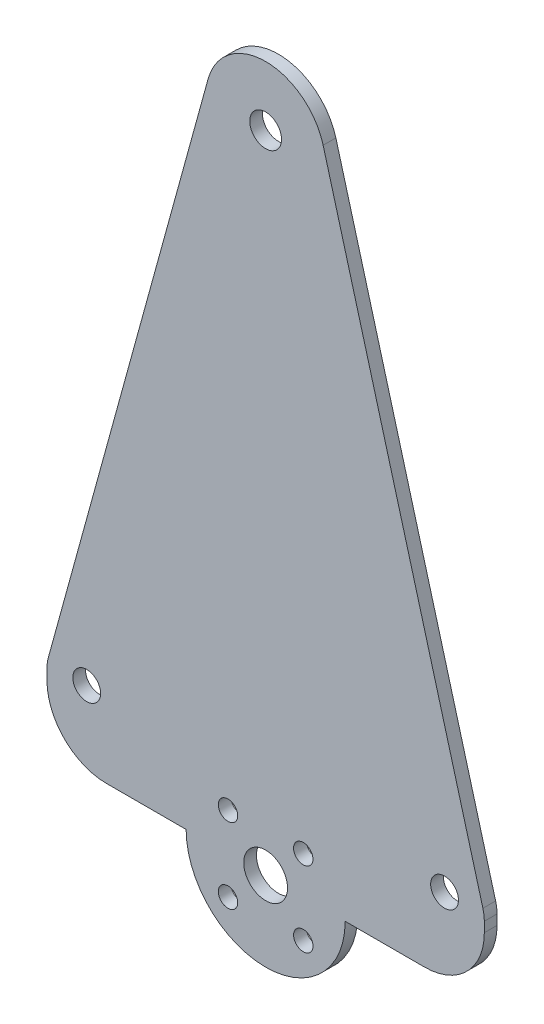
ISO-10303-21;
HEADER;
FILE_DESCRIPTION(('STEP AP214'),'2;1');
FILE_NAME('part.step','',(''),(''),'','','');
FILE_SCHEMA(('AUTOMOTIVE_DESIGN { 1 0 10303 214 1 1 1 1 }'));
ENDSEC;
DATA;
#1=APPLICATION_CONTEXT('core data for automotive mechanical design processes');
#2=APPLICATION_PROTOCOL_DEFINITION('international standard','automotive_design',2000,#1);
#3=PRODUCT_CONTEXT('',#1,'mechanical');
#4=PRODUCT('Part','Part','',(#3));
#5=PRODUCT_RELATED_PRODUCT_CATEGORY('part','',(#4));
#6=PRODUCT_DEFINITION_FORMATION('','',#4);
#7=PRODUCT_DEFINITION_CONTEXT('part definition',#1,'design');
#8=PRODUCT_DEFINITION('design','',#6,#7);
#9=PRODUCT_DEFINITION_SHAPE('','',#8);
#10=(LENGTH_UNIT() NAMED_UNIT(*) SI_UNIT(.MILLI.,.METRE.));
#11=(NAMED_UNIT(*) PLANE_ANGLE_UNIT() SI_UNIT($,.RADIAN.));
#12=(NAMED_UNIT(*) SI_UNIT($,.STERADIAN.) SOLID_ANGLE_UNIT());
#13=UNCERTAINTY_MEASURE_WITH_UNIT(LENGTH_MEASURE(1.E-05),#10,'distance_accuracy_value','');
#14=(GEOMETRIC_REPRESENTATION_CONTEXT(3) GLOBAL_UNCERTAINTY_ASSIGNED_CONTEXT((#13)) GLOBAL_UNIT_ASSIGNED_CONTEXT((#10,
#11,#12)) REPRESENTATION_CONTEXT('',''));
#15=CARTESIAN_POINT('',(0.,0.,0.));
#16=DIRECTION('',(0.,0.,1.));
#17=DIRECTION('',(1.,0.,0.));
#18=AXIS2_PLACEMENT_3D('',#15,#16,#17);
#19=CARTESIAN_POINT('',(0.,-0.85721364647119,2.032));
#20=DIRECTION('',(0.,0.,-1.));
#21=DIRECTION('',(-1.,0.,0.));
#22=AXIS2_PLACEMENT_3D('',#19,#20,#21);
#23=PLANE('',#22);
#24=CARTESIAN_POINT('',(34.5854076400856,-5.9593060063855,2.032));
#25=DIRECTION('',(0.,0.,1.));
#26=DIRECTION('',(1.,0.,0.));
#27=AXIS2_PLACEMENT_3D('',#24,#25,#26);
#28=CIRCLE('',#27,1.55);
#29=CARTESIAN_POINT('',(36.1354076400857,-5.9593060063855,2.032));
#30=VERTEX_POINT('',#29);
#31=EDGE_CURVE('E308',#30,#30,#28,.T.);
#32=ORIENTED_EDGE('',*,*,#31,.F.);
#33=EDGE_LOOP('',(#32));
#34=FACE_BOUND('',#33,.T.);
#35=CARTESIAN_POINT('',(28.575,-11.9697136464712,2.032));
#36=DIRECTION('',(0.,0.,1.));
#37=DIRECTION('',(1.,0.,0.));
#38=AXIS2_PLACEMENT_3D('',#35,#36,#37);
#39=CIRCLE('',#38,3.5);
#40=CARTESIAN_POINT('',(32.075,-11.9697136464712,2.032));
#41=VERTEX_POINT('',#40);
#42=EDGE_CURVE('E320',#41,#41,#39,.T.);
#43=ORIENTED_EDGE('',*,*,#42,.F.);
#44=EDGE_LOOP('',(#43));
#45=FACE_BOUND('',#44,.T.);
#46=CARTESIAN_POINT('',(28.5750000000013,91.0778159001085,2.032));
#47=DIRECTION('',(0.,0.,1.));
#48=DIRECTION('',(1.,0.,0.));
#49=AXIS2_PLACEMENT_3D('',#46,#47,#48);
#50=CIRCLE('',#49,2.53999999819223);
#51=CARTESIAN_POINT('',(31.1149999981935,91.0778159001085,2.032));
#52=VERTEX_POINT('',#51);
#53=EDGE_CURVE('E332',#52,#52,#50,.T.);
#54=ORIENTED_EDGE('',*,*,#53,.F.);
#55=EDGE_LOOP('',(#54));
#56=FACE_BOUND('',#55,.T.);
#57=CARTESIAN_POINT('',(0.,0.,2.032));
#58=DIRECTION('',(0.,0.,1.));
#59=DIRECTION('',(1.,0.,0.));
#60=AXIS2_PLACEMENT_3D('',#57,#58,#59);
#61=CIRCLE('',#60,2.2225);
#62=CARTESIAN_POINT('',(2.2225,0.,2.032));
#63=VERTEX_POINT('',#62);
#64=EDGE_CURVE('E158',#63,#63,#61,.T.);
#65=ORIENTED_EDGE('',*,*,#64,.F.);
#66=EDGE_LOOP('',(#65));
#67=FACE_BOUND('',#66,.T.);
#68=CARTESIAN_POINT('',(0.,-0.85721364647119,2.032));
#69=DIRECTION('',(0.,0.,1.));
#70=DIRECTION('',(-1.,0.,0.));
#71=AXIS2_PLACEMENT_3D('',#68,#69,#70);
#72=CIRCLE('',#71,6.34999999999994);
#73=CARTESIAN_POINT('',(-6.12270424433272,0.826530020607801,2.032));
#74=VERTEX_POINT('',#73);
#75=CARTESIAN_POINT('',(-6.35,-0.857213646471191,2.032));
#76=VERTEX_POINT('',#75);
#77=EDGE_CURVE('E177',#74,#76,#72,.T.);
#78=ORIENTED_EDGE('',*,*,#77,.T.);
#79=DIRECTION('',(0.,-1.,0.));
#80=VECTOR('',#79,1.);
#81=CARTESIAN_POINT('',(-6.35,-2.44471364647112,2.032));
#82=LINE('',#81,#80);
#83=CARTESIAN_POINT('',(-6.35,-2.44471364647112,2.032));
#84=VERTEX_POINT('',#83);
#85=EDGE_CURVE('E105',#76,#84,#82,.T.);
#86=ORIENTED_EDGE('',*,*,#85,.T.);
#87=CARTESIAN_POINT('',(3.175,-2.44471364647119,2.032));
#88=DIRECTION('',(0.,0.,1.));
#89=DIRECTION('',(1.,0.,0.));
#90=AXIS2_PLACEMENT_3D('',#87,#88,#89);
#91=CIRCLE('',#90,9.525);
#92=CARTESIAN_POINT('',(3.17500000000007,-11.9697136464712,2.032));
#93=VERTEX_POINT('',#92);
#94=EDGE_CURVE('E204',#84,#93,#91,.T.);
#95=ORIENTED_EDGE('',*,*,#94,.T.);
#96=DIRECTION('',(1.,0.,0.));
#97=VECTOR('',#96,1.);
#98=CARTESIAN_POINT('',(15.875,-11.9697136464712,2.032));
#99=LINE('',#98,#97);
#100=CARTESIAN_POINT('',(15.875,-11.9697136464712,2.032));
#101=VERTEX_POINT('',#100);
#102=EDGE_CURVE('E223',#93,#101,#99,.T.);
#103=ORIENTED_EDGE('',*,*,#102,.T.);
#104=CARTESIAN_POINT('',(28.575,-11.9697136464712,2.032));
#105=DIRECTION('',(0.,0.,1.));
#106=DIRECTION('',(1.,0.,0.));
#107=AXIS2_PLACEMENT_3D('',#104,#105,#106);
#108=CIRCLE('',#107,12.7);
#109=CARTESIAN_POINT('',(41.275,-11.9697136464711,2.032));
#110=VERTEX_POINT('',#109);
#111=EDGE_CURVE('E220',#101,#110,#108,.T.);
#112=ORIENTED_EDGE('',*,*,#111,.T.);
#113=DIRECTION('',(1.,0.,0.));
#114=VECTOR('',#113,1.);
#115=CARTESIAN_POINT('',(41.275,-11.9697136464711,2.032));
#116=LINE('',#115,#114);
#117=CARTESIAN_POINT('',(53.9750000000001,-11.9697136464711,2.032));
#118=VERTEX_POINT('',#117);
#119=EDGE_CURVE('E222',#110,#118,#116,.T.);
#120=ORIENTED_EDGE('',*,*,#119,.T.);
#121=CARTESIAN_POINT('',(53.9750000000002,-2.44471364647115,2.032));
#122=DIRECTION('',(0.,0.,1.));
#123=DIRECTION('',(1.,0.,0.));
#124=AXIS2_PLACEMENT_3D('',#121,#122,#123);
#125=CIRCLE('',#124,9.525);
#126=CARTESIAN_POINT('',(63.5000000000002,-2.44471364647108,2.032));
#127=VERTEX_POINT('',#126);
#128=EDGE_CURVE('E225',#118,#127,#125,.T.);
#129=ORIENTED_EDGE('',*,*,#128,.T.);
#130=DIRECTION('',(0.,1.,0.));
#131=VECTOR('',#130,1.);
#132=CARTESIAN_POINT('',(63.5000000000002,-0.85721364647109,2.032));
#133=LINE('',#132,#131);
#134=CARTESIAN_POINT('',(63.5000000000002,-0.85721364647109,2.032));
#135=VERTEX_POINT('',#134);
#136=EDGE_CURVE('E231',#127,#135,#133,.T.);
#137=ORIENTED_EDGE('',*,*,#136,.T.);
#138=CARTESIAN_POINT('',(57.1499999991986,-0.857213646471091,2.032));
#139=DIRECTION('',(0.,0.,1.));
#140=DIRECTION('',(1.,0.,0.));
#141=AXIS2_PLACEMENT_3D('',#138,#139,#140);
#142=CIRCLE('',#141,6.35000000080159);
#143=CARTESIAN_POINT('',(63.2727042443038,0.826530020822582,2.032));
#144=VERTEX_POINT('',#143);
#145=EDGE_CURVE('E136',#135,#144,#142,.T.);
#146=ORIENTED_EDGE('',*,*,#145,.T.);
#147=DIRECTION('',(-0.265156483004902,0.964205392808229,0.));
#148=VECTOR('',#147,1.);
#149=CARTESIAN_POINT('',(63.2727042443038,0.826530020822582,2.032));
#150=LINE('',#149,#148);
#151=CARTESIAN_POINT('',(37.7590563664997,93.6034314007302,2.032));
#152=VERTEX_POINT('',#151);
#153=EDGE_CURVE('E130',#144,#152,#150,.T.);
#154=ORIENTED_EDGE('',*,*,#153,.T.);
#155=CARTESIAN_POINT('',(28.5750000000013,91.0778159001085,2.032));
#156=DIRECTION('',(0.,0.,1.));
#157=DIRECTION('',(1.,0.,0.));
#158=AXIS2_PLACEMENT_3D('',#155,#156,#157);
#159=CIRCLE('',#158,9.525);
#160=CARTESIAN_POINT('',(19.3909436335022,93.6034314007276,2.032));
#161=VERTEX_POINT('',#160);
#162=EDGE_CURVE('E134',#152,#161,#159,.T.);
#163=ORIENTED_EDGE('',*,*,#162,.T.);
#164=DIRECTION('',(-0.265156483004636,-0.964205392808302,0.));
#165=VECTOR('',#164,1.);
#166=CARTESIAN_POINT('',(19.3909436335022,93.6034314007276,2.032));
#167=LINE('',#166,#165);
#168=EDGE_CURVE('E50',#161,#74,#167,.T.);
#169=ORIENTED_EDGE('',*,*,#168,.T.);
#170=EDGE_LOOP('',(#78,#86,#95,#103,#112,#120,#129,#137,#146,#154,#163,#169));
#171=FACE_BOUND('',#170,.T.);
#172=CARTESIAN_POINT('',(57.15,0.,2.032));
#173=DIRECTION('',(0.,0.,1.));
#174=DIRECTION('',(1.,0.,0.));
#175=AXIS2_PLACEMENT_3D('',#172,#173,#174);
#176=CIRCLE('',#175,2.2225);
#177=CARTESIAN_POINT('',(59.3725,0.,2.032));
#178=VERTEX_POINT('',#177);
#179=EDGE_CURVE('E338',#178,#178,#176,.T.);
#180=ORIENTED_EDGE('',*,*,#179,.F.);
#181=EDGE_LOOP('',(#180));
#182=FACE_BOUND('',#181,.T.);
#183=CARTESIAN_POINT('',(22.5645923599144,-5.95930600638551,2.032));
#184=DIRECTION('',(0.,0.,1.));
#185=DIRECTION('',(1.,0.,0.));
#186=AXIS2_PLACEMENT_3D('',#183,#184,#185);
#187=CIRCLE('',#186,1.55);
#188=CARTESIAN_POINT('',(24.1145923599144,-5.95930600638551,2.032));
#189=VERTEX_POINT('',#188);
#190=EDGE_CURVE('E326',#189,#189,#187,.T.);
#191=ORIENTED_EDGE('',*,*,#190,.F.);
#192=EDGE_LOOP('',(#191));
#193=FACE_BOUND('',#192,.T.);
#194=CARTESIAN_POINT('',(34.5854076400856,-17.9801212865568,2.032));
#195=DIRECTION('',(0.,0.,1.));
#196=DIRECTION('',(1.,0.,0.));
#197=AXIS2_PLACEMENT_3D('',#194,#195,#196);
#198=CIRCLE('',#197,1.55);
#199=CARTESIAN_POINT('',(36.1354076400857,-17.9801212865568,2.032));
#200=VERTEX_POINT('',#199);
#201=EDGE_CURVE('E314',#200,#200,#198,.T.);
#202=ORIENTED_EDGE('',*,*,#201,.F.);
#203=EDGE_LOOP('',(#202));
#204=FACE_BOUND('',#203,.T.);
#205=CARTESIAN_POINT('',(22.5645923599144,-17.9801212865569,2.032));
#206=DIRECTION('',(0.,0.,1.));
#207=DIRECTION('',(1.,0.,0.));
#208=AXIS2_PLACEMENT_3D('',#205,#206,#207);
#209=CIRCLE('',#208,1.55);
#210=CARTESIAN_POINT('',(24.1145923599143,-17.9801212865569,2.032));
#211=VERTEX_POINT('',#210);
#212=EDGE_CURVE('E299',#211,#211,#209,.T.);
#213=ORIENTED_EDGE('',*,*,#212,.F.);
#214=EDGE_LOOP('',(#213));
#215=FACE_BOUND('',#214,.T.);
#216=ADVANCED_FACE('F33',(#34,#45,#56,#67,#171,#182,#193,#204,#215),#23,.F.);
#217=CARTESIAN_POINT('',(0.,-0.85721364647119,0.));
#218=DIRECTION('',(0.,0.,-1.));
#219=DIRECTION('',(-1.,0.,0.));
#220=AXIS2_PLACEMENT_3D('',#217,#218,#219);
#221=PLANE('',#220);
#222=CARTESIAN_POINT('',(34.5854076400856,-5.9593060063855,0.));
#223=DIRECTION('',(0.,0.,1.));
#224=DIRECTION('',(1.,0.,0.));
#225=AXIS2_PLACEMENT_3D('',#222,#223,#224);
#226=CIRCLE('',#225,1.55);
#227=CARTESIAN_POINT('',(36.1354076400857,-5.9593060063855,0.));
#228=VERTEX_POINT('',#227);
#229=EDGE_CURVE('E305',#228,#228,#226,.T.);
#230=ORIENTED_EDGE('',*,*,#229,.T.);
#231=EDGE_LOOP('',(#230));
#232=FACE_BOUND('',#231,.T.);
#233=CARTESIAN_POINT('',(28.575,-11.9697136464712,0.));
#234=DIRECTION('',(0.,0.,1.));
#235=DIRECTION('',(1.,0.,0.));
#236=AXIS2_PLACEMENT_3D('',#233,#234,#235);
#237=CIRCLE('',#236,3.5);
#238=CARTESIAN_POINT('',(32.075,-11.9697136464712,0.));
#239=VERTEX_POINT('',#238);
#240=EDGE_CURVE('E317',#239,#239,#237,.T.);
#241=ORIENTED_EDGE('',*,*,#240,.T.);
#242=EDGE_LOOP('',(#241));
#243=FACE_BOUND('',#242,.T.);
#244=CARTESIAN_POINT('',(28.5750000000013,91.0778159001085,0.));
#245=DIRECTION('',(0.,0.,1.));
#246=DIRECTION('',(1.,0.,0.));
#247=AXIS2_PLACEMENT_3D('',#244,#245,#246);
#248=CIRCLE('',#247,2.53999999819223);
#249=CARTESIAN_POINT('',(31.1149999981935,91.0778159001085,0.));
#250=VERTEX_POINT('',#249);
#251=EDGE_CURVE('E329',#250,#250,#248,.T.);
#252=ORIENTED_EDGE('',*,*,#251,.T.);
#253=EDGE_LOOP('',(#252));
#254=FACE_BOUND('',#253,.T.);
#255=CARTESIAN_POINT('',(0.,0.,0.));
#256=DIRECTION('',(0.,0.,1.));
#257=DIRECTION('',(1.,0.,0.));
#258=AXIS2_PLACEMENT_3D('',#255,#256,#257);
#259=CIRCLE('',#258,2.2225);
#260=CARTESIAN_POINT('',(2.2225,0.,0.));
#261=VERTEX_POINT('',#260);
#262=EDGE_CURVE('E341',#261,#261,#259,.T.);
#263=ORIENTED_EDGE('',*,*,#262,.T.);
#264=EDGE_LOOP('',(#263));
#265=FACE_BOUND('',#264,.T.);
#266=CARTESIAN_POINT('',(0.,-0.85721364647119,0.));
#267=DIRECTION('',(0.,0.,1.));
#268=DIRECTION('',(-1.,0.,0.));
#269=AXIS2_PLACEMENT_3D('',#266,#267,#268);
#270=CIRCLE('',#269,6.34999999999994);
#271=CARTESIAN_POINT('',(-6.12270424433272,0.826530020607801,0.));
#272=VERTEX_POINT('',#271);
#273=CARTESIAN_POINT('',(-6.35,-0.857213646471191,0.));
#274=VERTEX_POINT('',#273);
#275=EDGE_CURVE('E154',#272,#274,#270,.T.);
#276=ORIENTED_EDGE('',*,*,#275,.F.);
#277=DIRECTION('',(-0.265156483004636,-0.964205392808302,0.));
#278=VECTOR('',#277,1.);
#279=CARTESIAN_POINT('',(19.3909436335022,93.6034314007276,0.));
#280=LINE('',#279,#278);
#281=CARTESIAN_POINT('',(19.3909436335022,93.6034314007276,0.));
#282=VERTEX_POINT('',#281);
#283=EDGE_CURVE('E97',#282,#272,#280,.T.);
#284=ORIENTED_EDGE('',*,*,#283,.F.);
#285=CARTESIAN_POINT('',(28.5750000000013,91.0778159001085,0.));
#286=DIRECTION('',(0.,0.,1.));
#287=DIRECTION('',(1.,0.,0.));
#288=AXIS2_PLACEMENT_3D('',#285,#286,#287);
#289=CIRCLE('',#288,9.525);
#290=CARTESIAN_POINT('',(37.7590563664997,93.6034314007302,0.));
#291=VERTEX_POINT('',#290);
#292=EDGE_CURVE('E91',#291,#282,#289,.T.);
#293=ORIENTED_EDGE('',*,*,#292,.F.);
#294=DIRECTION('',(-0.265156483004902,0.964205392808229,0.));
#295=VECTOR('',#294,1.);
#296=CARTESIAN_POINT('',(63.2727042443038,0.826530020822582,0.));
#297=LINE('',#296,#295);
#298=CARTESIAN_POINT('',(63.2727042443038,0.826530020822582,0.));
#299=VERTEX_POINT('',#298);
#300=EDGE_CURVE('E144',#299,#291,#297,.T.);
#301=ORIENTED_EDGE('',*,*,#300,.F.);
#302=CARTESIAN_POINT('',(57.1499999991986,-0.857213646471091,0.));
#303=DIRECTION('',(0.,0.,1.));
#304=DIRECTION('',(1.,0.,0.));
#305=AXIS2_PLACEMENT_3D('',#302,#303,#304);
#306=CIRCLE('',#305,6.35000000080159);
#307=CARTESIAN_POINT('',(63.5000000000002,-0.85721364647109,0.));
#308=VERTEX_POINT('',#307);
#309=EDGE_CURVE('E172',#308,#299,#306,.T.);
#310=ORIENTED_EDGE('',*,*,#309,.F.);
#311=DIRECTION('',(0.,1.,0.));
#312=VECTOR('',#311,1.);
#313=CARTESIAN_POINT('',(63.5000000000002,-0.85721364647109,0.));
#314=LINE('',#313,#312);
#315=CARTESIAN_POINT('',(63.5000000000002,-2.44471364647108,0.));
#316=VERTEX_POINT('',#315);
#317=EDGE_CURVE('E170',#316,#308,#314,.T.);
#318=ORIENTED_EDGE('',*,*,#317,.F.);
#319=CARTESIAN_POINT('',(53.9750000000002,-2.44471364647115,0.));
#320=DIRECTION('',(0.,0.,1.));
#321=DIRECTION('',(1.,0.,0.));
#322=AXIS2_PLACEMENT_3D('',#319,#320,#321);
#323=CIRCLE('',#322,9.525);
#324=CARTESIAN_POINT('',(53.9750000000001,-11.9697136464711,0.));
#325=VERTEX_POINT('',#324);
#326=EDGE_CURVE('E168',#325,#316,#323,.T.);
#327=ORIENTED_EDGE('',*,*,#326,.F.);
#328=DIRECTION('',(1.,0.,0.));
#329=VECTOR('',#328,1.);
#330=CARTESIAN_POINT('',(41.275,-11.9697136464711,0.));
#331=LINE('',#330,#329);
#332=CARTESIAN_POINT('',(41.275,-11.9697136464711,0.));
#333=VERTEX_POINT('',#332);
#334=EDGE_CURVE('E166',#333,#325,#331,.T.);
#335=ORIENTED_EDGE('',*,*,#334,.F.);
#336=CARTESIAN_POINT('',(28.575,-11.9697136464712,0.));
#337=DIRECTION('',(0.,0.,1.));
#338=DIRECTION('',(1.,0.,0.));
#339=AXIS2_PLACEMENT_3D('',#336,#337,#338);
#340=CIRCLE('',#339,12.7);
#341=CARTESIAN_POINT('',(15.875,-11.9697136464712,0.));
#342=VERTEX_POINT('',#341);
#343=EDGE_CURVE('E164',#342,#333,#340,.T.);
#344=ORIENTED_EDGE('',*,*,#343,.F.);
#345=DIRECTION('',(1.,0.,0.));
#346=VECTOR('',#345,1.);
#347=CARTESIAN_POINT('',(15.875,-11.9697136464712,0.));
#348=LINE('',#347,#346);
#349=CARTESIAN_POINT('',(3.17500000000007,-11.9697136464712,0.));
#350=VERTEX_POINT('',#349);
#351=EDGE_CURVE('E162',#350,#342,#348,.T.);
#352=ORIENTED_EDGE('',*,*,#351,.F.);
#353=CARTESIAN_POINT('',(3.175,-2.44471364647119,0.));
#354=DIRECTION('',(0.,0.,1.));
#355=DIRECTION('',(1.,0.,0.));
#356=AXIS2_PLACEMENT_3D('',#353,#354,#355);
#357=CIRCLE('',#356,9.525);
#358=CARTESIAN_POINT('',(-6.35,-2.44471364647112,0.));
#359=VERTEX_POINT('',#358);
#360=EDGE_CURVE('E160',#359,#350,#357,.T.);
#361=ORIENTED_EDGE('',*,*,#360,.F.);
#362=DIRECTION('',(0.,-1.,0.));
#363=VECTOR('',#362,1.);
#364=CARTESIAN_POINT('',(-6.35,-2.44471364647112,0.));
#365=LINE('',#364,#363);
#366=EDGE_CURVE('E157',#274,#359,#365,.T.);
#367=ORIENTED_EDGE('',*,*,#366,.F.);
#368=EDGE_LOOP('',(#276,#284,#293,#301,#310,#318,#327,#335,#344,#352,#361,#367));
#369=FACE_BOUND('',#368,.T.);
#370=CARTESIAN_POINT('',(57.15,0.,0.));
#371=DIRECTION('',(0.,0.,1.));
#372=DIRECTION('',(1.,0.,0.));
#373=AXIS2_PLACEMENT_3D('',#370,#371,#372);
#374=CIRCLE('',#373,2.2225);
#375=CARTESIAN_POINT('',(59.3725,0.,0.));
#376=VERTEX_POINT('',#375);
#377=EDGE_CURVE('E335',#376,#376,#374,.T.);
#378=ORIENTED_EDGE('',*,*,#377,.T.);
#379=EDGE_LOOP('',(#378));
#380=FACE_BOUND('',#379,.T.);
#381=CARTESIAN_POINT('',(22.5645923599144,-5.95930600638551,0.));
#382=DIRECTION('',(0.,0.,1.));
#383=DIRECTION('',(1.,0.,0.));
#384=AXIS2_PLACEMENT_3D('',#381,#382,#383);
#385=CIRCLE('',#384,1.55);
#386=CARTESIAN_POINT('',(24.1145923599144,-5.95930600638551,0.));
#387=VERTEX_POINT('',#386);
#388=EDGE_CURVE('E323',#387,#387,#385,.T.);
#389=ORIENTED_EDGE('',*,*,#388,.T.);
#390=EDGE_LOOP('',(#389));
#391=FACE_BOUND('',#390,.T.);
#392=CARTESIAN_POINT('',(34.5854076400856,-17.9801212865568,0.));
#393=DIRECTION('',(0.,0.,1.));
#394=DIRECTION('',(1.,0.,0.));
#395=AXIS2_PLACEMENT_3D('',#392,#393,#394);
#396=CIRCLE('',#395,1.55);
#397=CARTESIAN_POINT('',(36.1354076400857,-17.9801212865568,0.));
#398=VERTEX_POINT('',#397);
#399=EDGE_CURVE('E311',#398,#398,#396,.T.);
#400=ORIENTED_EDGE('',*,*,#399,.T.);
#401=EDGE_LOOP('',(#400));
#402=FACE_BOUND('',#401,.T.);
#403=CARTESIAN_POINT('',(22.5645923599144,-17.9801212865569,0.));
#404=DIRECTION('',(0.,0.,1.));
#405=DIRECTION('',(1.,0.,0.));
#406=AXIS2_PLACEMENT_3D('',#403,#404,#405);
#407=CIRCLE('',#406,1.55);
#408=CARTESIAN_POINT('',(24.1145923599143,-17.9801212865569,0.));
#409=VERTEX_POINT('',#408);
#410=EDGE_CURVE('E302',#409,#409,#407,.T.);
#411=ORIENTED_EDGE('',*,*,#410,.T.);
#412=EDGE_LOOP('',(#411));
#413=FACE_BOUND('',#412,.T.);
#414=ADVANCED_FACE('F208',(#232,#243,#254,#265,#369,#380,#391,#402,#413),#221,.T.);
#415=CARTESIAN_POINT('',(0.,-0.85721364647119,2.032));
#416=DIRECTION('',(0.,0.,-1.));
#417=DIRECTION('',(-1.,0.,0.));
#418=AXIS2_PLACEMENT_3D('',#415,#416,#417);
#419=CYLINDRICAL_SURFACE('',#418,6.34999999999994);
#420=ORIENTED_EDGE('',*,*,#275,.T.);
#421=DIRECTION('',(0.,0.,-1.));
#422=VECTOR('',#421,1.);
#423=CARTESIAN_POINT('',(-6.35,-0.857213646471191,2.032));
#424=LINE('',#423,#422);
#425=EDGE_CURVE('E11',#76,#274,#424,.T.);
#426=ORIENTED_EDGE('',*,*,#425,.F.);
#427=ORIENTED_EDGE('',*,*,#77,.F.);
#428=DIRECTION('',(0.,0.,-1.));
#429=VECTOR('',#428,1.);
#430=CARTESIAN_POINT('',(-6.12270424433272,0.826530020607801,2.032));
#431=LINE('',#430,#429);
#432=EDGE_CURVE('E150',#74,#272,#431,.T.);
#433=ORIENTED_EDGE('',*,*,#432,.T.);
#434=EDGE_LOOP('',(#420,#426,#427,#433));
#435=FACE_BOUND('',#434,.T.);
#436=ADVANCED_FACE('F35',(#435),#419,.T.);
#437=CARTESIAN_POINT('',(-6.35,-2.44471364647112,2.032));
#438=DIRECTION('',(1.,0.,0.));
#439=DIRECTION('',(0.,0.,-1.));
#440=AXIS2_PLACEMENT_3D('',#437,#438,#439);
#441=PLANE('',#440);
#442=ORIENTED_EDGE('',*,*,#366,.T.);
#443=DIRECTION('',(0.,0.,-1.));
#444=VECTOR('',#443,1.);
#445=CARTESIAN_POINT('',(-6.35,-2.44471364647112,2.032));
#446=LINE('',#445,#444);
#447=EDGE_CURVE('E42',#84,#359,#446,.T.);
#448=ORIENTED_EDGE('',*,*,#447,.F.);
#449=ORIENTED_EDGE('',*,*,#85,.F.);
#450=ORIENTED_EDGE('',*,*,#425,.T.);
#451=EDGE_LOOP('',(#442,#448,#449,#450));
#452=FACE_BOUND('',#451,.T.);
#453=ADVANCED_FACE('F486',(#452),#441,.F.);
#454=CARTESIAN_POINT('',(3.175,-2.44471364647119,2.032));
#455=DIRECTION('',(0.,0.,-1.));
#456=DIRECTION('',(-1.,0.,0.));
#457=AXIS2_PLACEMENT_3D('',#454,#455,#456);
#458=CYLINDRICAL_SURFACE('',#457,9.525);
#459=ORIENTED_EDGE('',*,*,#360,.T.);
#460=DIRECTION('',(0.,0.,-1.));
#461=VECTOR('',#460,1.);
#462=CARTESIAN_POINT('',(3.17500000000007,-11.9697136464712,2.032));
#463=LINE('',#462,#461);
#464=EDGE_CURVE('E196',#93,#350,#463,.T.);
#465=ORIENTED_EDGE('',*,*,#464,.F.);
#466=ORIENTED_EDGE('',*,*,#94,.F.);
#467=ORIENTED_EDGE('',*,*,#447,.T.);
#468=EDGE_LOOP('',(#459,#465,#466,#467));
#469=FACE_BOUND('',#468,.T.);
#470=ADVANCED_FACE('F202',(#469),#458,.T.);
#471=CARTESIAN_POINT('',(15.875,-11.9697136464712,2.032));
#472=DIRECTION('',(0.,1.,0.));
#473=DIRECTION('',(-1.,0.,0.));
#474=AXIS2_PLACEMENT_3D('',#471,#472,#473);
#475=PLANE('',#474);
#476=ORIENTED_EDGE('',*,*,#351,.T.);
#477=DIRECTION('',(0.,0.,-1.));
#478=VECTOR('',#477,1.);
#479=CARTESIAN_POINT('',(15.875,-11.9697136464712,2.032));
#480=LINE('',#479,#478);
#481=EDGE_CURVE('E193',#101,#342,#480,.T.);
#482=ORIENTED_EDGE('',*,*,#481,.F.);
#483=ORIENTED_EDGE('',*,*,#102,.F.);
#484=ORIENTED_EDGE('',*,*,#464,.T.);
#485=EDGE_LOOP('',(#476,#482,#483,#484));
#486=FACE_BOUND('',#485,.T.);
#487=ADVANCED_FACE('F214',(#486),#475,.F.);
#488=CARTESIAN_POINT('',(28.575,-11.9697136464712,2.032));
#489=DIRECTION('',(0.,0.,-1.));
#490=DIRECTION('',(-1.,0.,0.));
#491=AXIS2_PLACEMENT_3D('',#488,#489,#490);
#492=CYLINDRICAL_SURFACE('',#491,12.7);
#493=ORIENTED_EDGE('',*,*,#343,.T.);
#494=DIRECTION('',(0.,0.,-1.));
#495=VECTOR('',#494,1.);
#496=CARTESIAN_POINT('',(41.275,-11.9697136464711,2.032));
#497=LINE('',#496,#495);
#498=EDGE_CURVE('E190',#110,#333,#497,.T.);
#499=ORIENTED_EDGE('',*,*,#498,.F.);
#500=ORIENTED_EDGE('',*,*,#111,.F.);
#501=ORIENTED_EDGE('',*,*,#481,.T.);
#502=EDGE_LOOP('',(#493,#499,#500,#501));
#503=FACE_BOUND('',#502,.T.);
#504=ADVANCED_FACE('F218',(#503),#492,.T.);
#505=CARTESIAN_POINT('',(41.275,-11.9697136464711,2.032));
#506=DIRECTION('',(0.,1.,0.));
#507=DIRECTION('',(0.,0.,1.));
#508=AXIS2_PLACEMENT_3D('',#505,#506,#507);
#509=PLANE('',#508);
#510=ORIENTED_EDGE('',*,*,#334,.T.);
#511=DIRECTION('',(0.,0.,-1.));
#512=VECTOR('',#511,1.);
#513=CARTESIAN_POINT('',(53.9750000000001,-11.9697136464711,2.032));
#514=LINE('',#513,#512);
#515=EDGE_CURVE('E187',#118,#325,#514,.T.);
#516=ORIENTED_EDGE('',*,*,#515,.F.);
#517=ORIENTED_EDGE('',*,*,#119,.F.);
#518=ORIENTED_EDGE('',*,*,#498,.T.);
#519=EDGE_LOOP('',(#510,#516,#517,#518));
#520=FACE_BOUND('',#519,.T.);
#521=ADVANCED_FACE('F451',(#520),#509,.F.);
#522=CARTESIAN_POINT('',(53.9750000000002,-2.44471364647115,2.032));
#523=DIRECTION('',(0.,0.,-1.));
#524=DIRECTION('',(-1.,0.,0.));
#525=AXIS2_PLACEMENT_3D('',#522,#523,#524);
#526=CYLINDRICAL_SURFACE('',#525,9.525);
#527=ORIENTED_EDGE('',*,*,#326,.T.);
#528=DIRECTION('',(0.,0.,-1.));
#529=VECTOR('',#528,1.);
#530=CARTESIAN_POINT('',(63.5000000000002,-2.44471364647108,2.032));
#531=LINE('',#530,#529);
#532=EDGE_CURVE('E184',#127,#316,#531,.T.);
#533=ORIENTED_EDGE('',*,*,#532,.F.);
#534=ORIENTED_EDGE('',*,*,#128,.F.);
#535=ORIENTED_EDGE('',*,*,#515,.T.);
#536=EDGE_LOOP('',(#527,#533,#534,#535));
#537=FACE_BOUND('',#536,.T.);
#538=ADVANCED_FACE('F442',(#537),#526,.T.);
#539=CARTESIAN_POINT('',(63.5000000000002,-0.85721364647109,2.032));
#540=DIRECTION('',(-1.,0.,0.));
#541=DIRECTION('',(0.,0.,1.));
#542=AXIS2_PLACEMENT_3D('',#539,#540,#541);
#543=PLANE('',#542);
#544=ORIENTED_EDGE('',*,*,#317,.T.);
#545=DIRECTION('',(0.,0.,-1.));
#546=VECTOR('',#545,1.);
#547=CARTESIAN_POINT('',(63.5000000000002,-0.85721364647109,2.032));
#548=LINE('',#547,#546);
#549=EDGE_CURVE('E181',#135,#308,#548,.T.);
#550=ORIENTED_EDGE('',*,*,#549,.F.);
#551=ORIENTED_EDGE('',*,*,#136,.F.);
#552=ORIENTED_EDGE('',*,*,#532,.T.);
#553=EDGE_LOOP('',(#544,#550,#551,#552));
#554=FACE_BOUND('',#553,.T.);
#555=ADVANCED_FACE('F237',(#554),#543,.F.);
#556=CARTESIAN_POINT('',(57.1499999991986,-0.857213646471091,2.032));
#557=DIRECTION('',(0.,0.,-1.));
#558=DIRECTION('',(-1.,0.,0.));
#559=AXIS2_PLACEMENT_3D('',#556,#557,#558);
#560=CYLINDRICAL_SURFACE('',#559,6.35000000080159);
#561=ORIENTED_EDGE('',*,*,#309,.T.);
#562=DIRECTION('',(0.,0.,-1.));
#563=VECTOR('',#562,1.);
#564=CARTESIAN_POINT('',(63.2727042443038,0.826530020822582,2.032));
#565=LINE('',#564,#563);
#566=EDGE_CURVE('E145',#144,#299,#565,.T.);
#567=ORIENTED_EDGE('',*,*,#566,.F.);
#568=ORIENTED_EDGE('',*,*,#145,.F.);
#569=ORIENTED_EDGE('',*,*,#549,.T.);
#570=EDGE_LOOP('',(#561,#567,#568,#569));
#571=FACE_BOUND('',#570,.T.);
#572=ADVANCED_FACE('F241',(#571),#560,.T.);
#573=CARTESIAN_POINT('',(63.2727042443038,0.826530020822582,2.032));
#574=DIRECTION('',(-0.964205392808229,-0.265156483004902,0.));
#575=DIRECTION('',(0.265156483004902,-0.964205392808229,0.));
#576=AXIS2_PLACEMENT_3D('',#573,#574,#575);
#577=PLANE('',#576);
#578=ORIENTED_EDGE('',*,*,#300,.T.);
#579=DIRECTION('',(0.,0.,-1.));
#580=VECTOR('',#579,1.);
#581=CARTESIAN_POINT('',(37.7590563664997,93.6034314007302,2.032));
#582=LINE('',#581,#580);
#583=EDGE_CURVE('E141',#152,#291,#582,.T.);
#584=ORIENTED_EDGE('',*,*,#583,.F.);
#585=ORIENTED_EDGE('',*,*,#153,.F.);
#586=ORIENTED_EDGE('',*,*,#566,.T.);
#587=EDGE_LOOP('',(#578,#584,#585,#586));
#588=FACE_BOUND('',#587,.T.);
#589=ADVANCED_FACE('F142',(#588),#577,.F.);
#590=CARTESIAN_POINT('',(28.5750000000013,91.0778159001085,2.032));
#591=DIRECTION('',(0.,0.,-1.));
#592=DIRECTION('',(-1.,0.,0.));
#593=AXIS2_PLACEMENT_3D('',#590,#591,#592);
#594=CYLINDRICAL_SURFACE('',#593,9.525);
#595=ORIENTED_EDGE('',*,*,#292,.T.);
#596=DIRECTION('',(0.,0.,-1.));
#597=VECTOR('',#596,1.);
#598=CARTESIAN_POINT('',(19.3909436335022,93.6034314007276,2.032));
#599=LINE('',#598,#597);
#600=EDGE_CURVE('E146',#161,#282,#599,.T.);
#601=ORIENTED_EDGE('',*,*,#600,.F.);
#602=ORIENTED_EDGE('',*,*,#162,.F.);
#603=ORIENTED_EDGE('',*,*,#583,.T.);
#604=EDGE_LOOP('',(#595,#601,#602,#603));
#605=FACE_BOUND('',#604,.T.);
#606=ADVANCED_FACE('F148',(#605),#594,.T.);
#607=CARTESIAN_POINT('',(19.3909436335022,93.6034314007276,2.032));
#608=DIRECTION('',(0.964205392808302,-0.265156483004636,0.));
#609=DIRECTION('',(0.265156483004636,0.964205392808302,0.));
#610=AXIS2_PLACEMENT_3D('',#607,#608,#609);
#611=PLANE('',#610);
#612=ORIENTED_EDGE('',*,*,#283,.T.);
#613=ORIENTED_EDGE('',*,*,#432,.F.);
#614=ORIENTED_EDGE('',*,*,#168,.F.);
#615=ORIENTED_EDGE('',*,*,#600,.T.);
#616=EDGE_LOOP('',(#612,#613,#614,#615));
#617=FACE_BOUND('',#616,.T.);
#618=ADVANCED_FACE('F245',(#617),#611,.F.);
#619=CARTESIAN_POINT('',(0.,0.,2.032));
#620=DIRECTION('',(0.,0.,-1.));
#621=DIRECTION('',(-1.,0.,0.));
#622=AXIS2_PLACEMENT_3D('',#619,#620,#621);
#623=CYLINDRICAL_SURFACE('',#622,2.2225);
#624=ORIENTED_EDGE('',*,*,#64,.T.);
#625=EDGE_LOOP('',(#624));
#626=FACE_BOUND('',#625,.T.);
#627=ORIENTED_EDGE('',*,*,#262,.F.);
#628=EDGE_LOOP('',(#627));
#629=FACE_BOUND('',#628,.T.);
#630=ADVANCED_FACE('F247',(#626,#629),#623,.F.);
#631=CARTESIAN_POINT('',(57.15,0.,2.032));
#632=DIRECTION('',(0.,0.,-1.));
#633=DIRECTION('',(-1.,0.,0.));
#634=AXIS2_PLACEMENT_3D('',#631,#632,#633);
#635=CYLINDRICAL_SURFACE('',#634,2.2225);
#636=ORIENTED_EDGE('',*,*,#179,.T.);
#637=EDGE_LOOP('',(#636));
#638=FACE_BOUND('',#637,.T.);
#639=ORIENTED_EDGE('',*,*,#377,.F.);
#640=EDGE_LOOP('',(#639));
#641=FACE_BOUND('',#640,.T.);
#642=ADVANCED_FACE('F253',(#638,#641),#635,.F.);
#643=CARTESIAN_POINT('',(28.5750000000013,91.0778159001085,2.032));
#644=DIRECTION('',(0.,0.,-1.));
#645=DIRECTION('',(-1.,0.,0.));
#646=AXIS2_PLACEMENT_3D('',#643,#644,#645);
#647=CYLINDRICAL_SURFACE('',#646,2.53999999819223);
#648=ORIENTED_EDGE('',*,*,#53,.T.);
#649=EDGE_LOOP('',(#648));
#650=FACE_BOUND('',#649,.T.);
#651=ORIENTED_EDGE('',*,*,#251,.F.);
#652=EDGE_LOOP('',(#651));
#653=FACE_BOUND('',#652,.T.);
#654=ADVANCED_FACE('F270',(#650,#653),#647,.F.);
#655=CARTESIAN_POINT('',(22.5645923599144,-5.95930600638551,2.032));
#656=DIRECTION('',(0.,0.,-1.));
#657=DIRECTION('',(-1.,0.,0.));
#658=AXIS2_PLACEMENT_3D('',#655,#656,#657);
#659=CYLINDRICAL_SURFACE('',#658,1.55);
#660=ORIENTED_EDGE('',*,*,#190,.T.);
#661=EDGE_LOOP('',(#660));
#662=FACE_BOUND('',#661,.T.);
#663=ORIENTED_EDGE('',*,*,#388,.F.);
#664=EDGE_LOOP('',(#663));
#665=FACE_BOUND('',#664,.T.);
#666=ADVANCED_FACE('F274',(#662,#665),#659,.F.);
#667=CARTESIAN_POINT('',(28.575,-11.9697136464712,2.032));
#668=DIRECTION('',(0.,0.,-1.));
#669=DIRECTION('',(-1.,0.,0.));
#670=AXIS2_PLACEMENT_3D('',#667,#668,#669);
#671=CYLINDRICAL_SURFACE('',#670,3.5);
#672=ORIENTED_EDGE('',*,*,#42,.T.);
#673=EDGE_LOOP('',(#672));
#674=FACE_BOUND('',#673,.T.);
#675=ORIENTED_EDGE('',*,*,#240,.F.);
#676=EDGE_LOOP('',(#675));
#677=FACE_BOUND('',#676,.T.);
#678=ADVANCED_FACE('F278',(#674,#677),#671,.F.);
#679=CARTESIAN_POINT('',(34.5854076400856,-17.9801212865568,2.032));
#680=DIRECTION('',(0.,0.,-1.));
#681=DIRECTION('',(-1.,0.,0.));
#682=AXIS2_PLACEMENT_3D('',#679,#680,#681);
#683=CYLINDRICAL_SURFACE('',#682,1.55);
#684=ORIENTED_EDGE('',*,*,#201,.T.);
#685=EDGE_LOOP('',(#684));
#686=FACE_BOUND('',#685,.T.);
#687=ORIENTED_EDGE('',*,*,#399,.F.);
#688=EDGE_LOOP('',(#687));
#689=FACE_BOUND('',#688,.T.);
#690=ADVANCED_FACE('F282',(#686,#689),#683,.F.);
#691=CARTESIAN_POINT('',(34.5854076400856,-5.9593060063855,2.032));
#692=DIRECTION('',(0.,0.,-1.));
#693=DIRECTION('',(-1.,0.,0.));
#694=AXIS2_PLACEMENT_3D('',#691,#692,#693);
#695=CYLINDRICAL_SURFACE('',#694,1.55);
#696=ORIENTED_EDGE('',*,*,#31,.T.);
#697=EDGE_LOOP('',(#696));
#698=FACE_BOUND('',#697,.T.);
#699=ORIENTED_EDGE('',*,*,#229,.F.);
#700=EDGE_LOOP('',(#699));
#701=FACE_BOUND('',#700,.T.);
#702=ADVANCED_FACE('F286',(#698,#701),#695,.F.);
#703=CARTESIAN_POINT('',(22.5645923599144,-17.9801212865569,2.032));
#704=DIRECTION('',(0.,0.,-1.));
#705=DIRECTION('',(-1.,0.,0.));
#706=AXIS2_PLACEMENT_3D('',#703,#704,#705);
#707=CYLINDRICAL_SURFACE('',#706,1.55);
#708=ORIENTED_EDGE('',*,*,#212,.T.);
#709=EDGE_LOOP('',(#708));
#710=FACE_BOUND('',#709,.T.);
#711=ORIENTED_EDGE('',*,*,#410,.F.);
#712=EDGE_LOOP('',(#711));
#713=FACE_BOUND('',#712,.T.);
#714=ADVANCED_FACE('F290',(#710,#713),#707,.F.);
#715=CLOSED_SHELL('',(#216,#414,#436,#453,#470,#487,#504,#521,#538,#555,#572,#589,#606,#618,
#630,#642,#654,#666,#678,#690,#702,#714));
#716=MANIFOLD_SOLID_BREP('B2',#715);
#717=ADVANCED_BREP_SHAPE_REPRESENTATION('',(#18,#716),#14);
#718=SHAPE_DEFINITION_REPRESENTATION(#9,#717);
ENDSEC;
END-ISO-10303-21;
